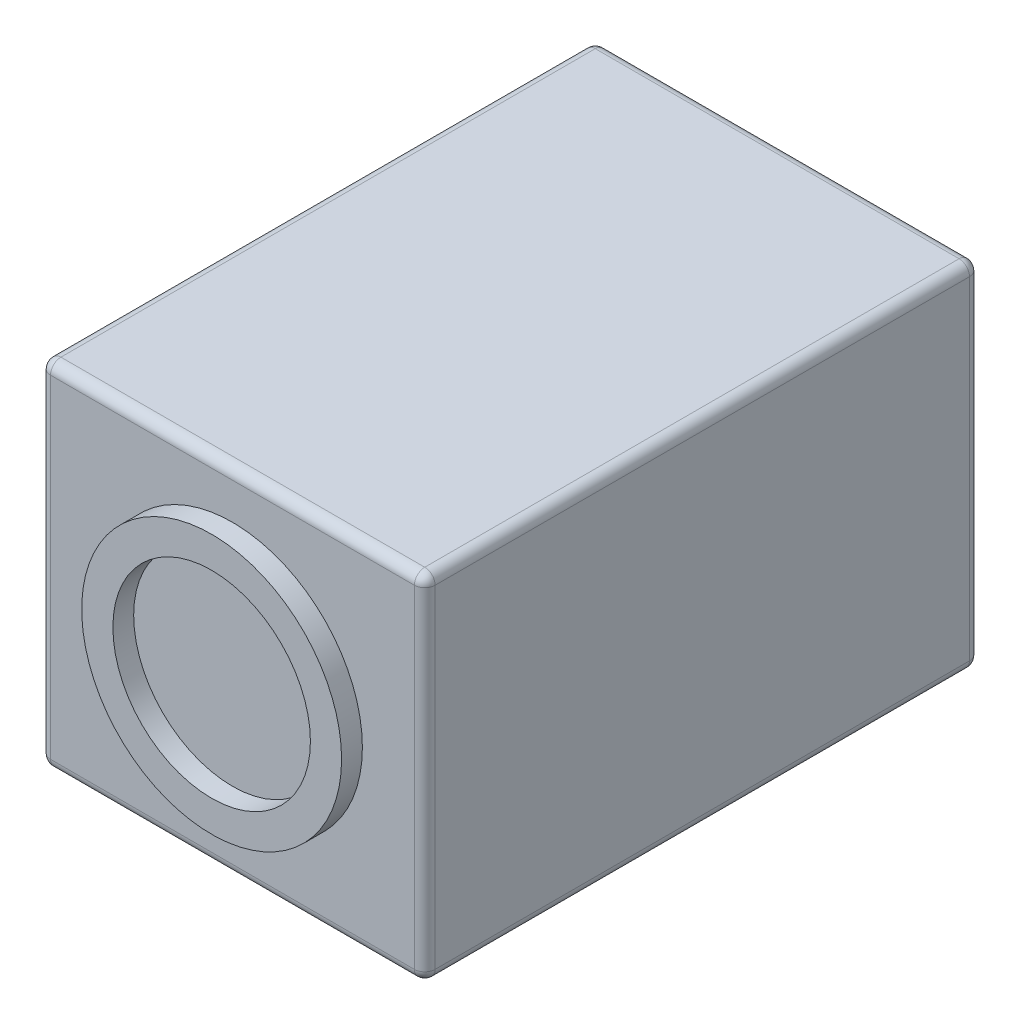
ISO-10303-21;
HEADER;
FILE_DESCRIPTION(('STEP AP214'),'2;1');
FILE_NAME('part.step','',(''),(''),'','','');
FILE_SCHEMA(('AUTOMOTIVE_DESIGN { 1 0 10303 214 1 1 1 1 }'));
ENDSEC;
DATA;
#1=APPLICATION_CONTEXT('core data for automotive mechanical design processes');
#2=APPLICATION_PROTOCOL_DEFINITION('international standard','automotive_design',2000,#1);
#3=PRODUCT_CONTEXT('',#1,'mechanical');
#4=PRODUCT('Part','Part','',(#3));
#5=PRODUCT_RELATED_PRODUCT_CATEGORY('part','',(#4));
#6=PRODUCT_DEFINITION_FORMATION('','',#4);
#7=PRODUCT_DEFINITION_CONTEXT('part definition',#1,'design');
#8=PRODUCT_DEFINITION('design','',#6,#7);
#9=PRODUCT_DEFINITION_SHAPE('','',#8);
#10=(LENGTH_UNIT() NAMED_UNIT(*) SI_UNIT(.MILLI.,.METRE.));
#11=(NAMED_UNIT(*) PLANE_ANGLE_UNIT() SI_UNIT($,.RADIAN.));
#12=(NAMED_UNIT(*) SI_UNIT($,.STERADIAN.) SOLID_ANGLE_UNIT());
#13=UNCERTAINTY_MEASURE_WITH_UNIT(LENGTH_MEASURE(1.E-05),#10,'distance_accuracy_value','');
#14=(GEOMETRIC_REPRESENTATION_CONTEXT(3) GLOBAL_UNCERTAINTY_ASSIGNED_CONTEXT((#13)) GLOBAL_UNIT_ASSIGNED_CONTEXT((#10,
#11,#12)) REPRESENTATION_CONTEXT('',''));
#15=CARTESIAN_POINT('',(0.,0.,0.));
#16=DIRECTION('',(0.,0.,1.));
#17=DIRECTION('',(1.,0.,0.));
#18=AXIS2_PLACEMENT_3D('',#15,#16,#17);
#19=CARTESIAN_POINT('',(-23.495,-21.59,67.818));
#20=DIRECTION('',(0.,0.,1.));
#21=DIRECTION('',(1.,0.,0.));
#22=AXIS2_PLACEMENT_3D('',#19,#20,#21);
#23=PLANE('',#22);
#24=DIRECTION('',(0.,-1.,0.));
#25=VECTOR('',#24,1.);
#26=CARTESIAN_POINT('',(-22.225,-21.59,67.818));
#27=LINE('',#26,#25);
#28=CARTESIAN_POINT('',(-22.225,20.32,67.818));
#29=VERTEX_POINT('',#28);
#30=CARTESIAN_POINT('',(-22.225,-20.32,67.818));
#31=VERTEX_POINT('',#30);
#32=EDGE_CURVE('E132',#29,#31,#27,.T.);
#33=ORIENTED_EDGE('',*,*,#32,.T.);
#34=DIRECTION('',(1.,0.,0.));
#35=VECTOR('',#34,1.);
#36=CARTESIAN_POINT('',(23.495,-20.32,67.818));
#37=LINE('',#36,#35);
#38=CARTESIAN_POINT('',(22.225,-20.32,67.818));
#39=VERTEX_POINT('',#38);
#40=EDGE_CURVE('E128',#31,#39,#37,.T.);
#41=ORIENTED_EDGE('',*,*,#40,.T.);
#42=DIRECTION('',(0.,1.,0.));
#43=VECTOR('',#42,1.);
#44=CARTESIAN_POINT('',(22.225,21.59,67.818));
#45=LINE('',#44,#43);
#46=CARTESIAN_POINT('',(22.225,20.32,67.818));
#47=VERTEX_POINT('',#46);
#48=EDGE_CURVE('E122',#39,#47,#45,.T.);
#49=ORIENTED_EDGE('',*,*,#48,.T.);
#50=DIRECTION('',(-1.,0.,0.));
#51=VECTOR('',#50,1.);
#52=CARTESIAN_POINT('',(-23.495,20.32,67.818));
#53=LINE('',#52,#51);
#54=EDGE_CURVE('E125',#47,#29,#53,.T.);
#55=ORIENTED_EDGE('',*,*,#54,.T.);
#56=EDGE_LOOP('',(#33,#41,#49,#55));
#57=FACE_BOUND('',#56,.T.);
#58=CARTESIAN_POINT('',(0.,0.,67.818));
#59=DIRECTION('',(0.,0.,1.));
#60=DIRECTION('',(1.,0.,0.));
#61=AXIS2_PLACEMENT_3D('',#58,#59,#60);
#62=CIRCLE('',#61,15.875);
#63=CARTESIAN_POINT('',(15.875,0.,67.818));
#64=VERTEX_POINT('',#63);
#65=EDGE_CURVE('E299',#64,#64,#62,.T.);
#66=ORIENTED_EDGE('',*,*,#65,.F.);
#67=EDGE_LOOP('',(#66));
#68=FACE_BOUND('',#67,.T.);
#69=ADVANCED_FACE('F34',(#57,#68),#23,.T.);
#70=CARTESIAN_POINT('',(-23.495,21.59,67.818));
#71=DIRECTION('',(1.,0.,0.));
#72=DIRECTION('',(0.,1.,0.));
#73=AXIS2_PLACEMENT_3D('',#70,#71,#72);
#74=PLANE('',#73);
#75=DIRECTION('',(0.,0.,-1.));
#76=VECTOR('',#75,1.);
#77=CARTESIAN_POINT('',(-23.495,-20.32,67.818));
#78=LINE('',#77,#76);
#79=CARTESIAN_POINT('',(-23.495,-20.32,1.26999999999999));
#80=VERTEX_POINT('',#79);
#81=CARTESIAN_POINT('',(-23.495,-20.32,66.548));
#82=VERTEX_POINT('',#81);
#83=EDGE_CURVE('E230',#80,#82,#78,.F.);
#84=ORIENTED_EDGE('',*,*,#83,.T.);
#85=DIRECTION('',(0.,-1.,0.));
#86=VECTOR('',#85,1.);
#87=CARTESIAN_POINT('',(-23.495,21.59,66.548));
#88=LINE('',#87,#86);
#89=CARTESIAN_POINT('',(-23.495,20.32,66.548));
#90=VERTEX_POINT('',#89);
#91=EDGE_CURVE('E232',#82,#90,#88,.F.);
#92=ORIENTED_EDGE('',*,*,#91,.T.);
#93=DIRECTION('',(0.,0.,-1.));
#94=VECTOR('',#93,1.);
#95=CARTESIAN_POINT('',(-23.495,20.32,67.818));
#96=LINE('',#95,#94);
#97=CARTESIAN_POINT('',(-23.495,20.32,1.26999999999999));
#98=VERTEX_POINT('',#97);
#99=EDGE_CURVE('E226',#90,#98,#96,.T.);
#100=ORIENTED_EDGE('',*,*,#99,.T.);
#101=DIRECTION('',(0.,-1.,0.));
#102=VECTOR('',#101,1.);
#103=CARTESIAN_POINT('',(-23.495,21.59,1.26999999999999));
#104=LINE('',#103,#102);
#105=EDGE_CURVE('E228',#98,#80,#104,.T.);
#106=ORIENTED_EDGE('',*,*,#105,.T.);
#107=EDGE_LOOP('',(#84,#92,#100,#106));
#108=FACE_BOUND('',#107,.T.);
#109=ADVANCED_FACE('F36',(#108),#74,.F.);
#110=CARTESIAN_POINT('',(-23.495,-21.59,67.818));
#111=DIRECTION('',(0.,1.,0.));
#112=DIRECTION('',(-1.,0.,0.));
#113=AXIS2_PLACEMENT_3D('',#110,#111,#112);
#114=PLANE('',#113);
#115=CARTESIAN_POINT('',(10.795,-21.59,39.1795));
#116=DIRECTION('',(0.,-1.,0.));
#117=DIRECTION('',(1.,0.,0.));
#118=AXIS2_PLACEMENT_3D('',#115,#116,#117);
#119=CIRCLE('',#118,1.0795);
#120=CARTESIAN_POINT('',(11.8745,-21.59,39.1795));
#121=VERTEX_POINT('',#120);
#122=EDGE_CURVE('E314',#121,#121,#119,.T.);
#123=ORIENTED_EDGE('',*,*,#122,.F.);
#124=EDGE_LOOP('',(#123));
#125=FACE_BOUND('',#124,.T.);
#126=CARTESIAN_POINT('',(-10.922,-21.59,39.1795));
#127=DIRECTION('',(0.,-1.,0.));
#128=DIRECTION('',(1.,0.,0.));
#129=AXIS2_PLACEMENT_3D('',#126,#127,#128);
#130=CIRCLE('',#129,1.0795);
#131=CARTESIAN_POINT('',(-9.8425,-21.59,39.1795));
#132=VERTEX_POINT('',#131);
#133=EDGE_CURVE('E308',#132,#132,#130,.T.);
#134=ORIENTED_EDGE('',*,*,#133,.F.);
#135=EDGE_LOOP('',(#134));
#136=FACE_BOUND('',#135,.T.);
#137=DIRECTION('',(1.,0.,0.));
#138=VECTOR('',#137,1.);
#139=CARTESIAN_POINT('',(-23.495,-21.59,1.26999999999999));
#140=LINE('',#139,#138);
#141=CARTESIAN_POINT('',(-22.225,-21.59,1.26999999999999));
#142=VERTEX_POINT('',#141);
#143=CARTESIAN_POINT('',(22.225,-21.59,1.26999999999999));
#144=VERTEX_POINT('',#143);
#145=EDGE_CURVE('E202',#142,#144,#140,.T.);
#146=ORIENTED_EDGE('',*,*,#145,.T.);
#147=DIRECTION('',(0.,0.,-1.));
#148=VECTOR('',#147,1.);
#149=CARTESIAN_POINT('',(22.225,-21.59,67.818));
#150=LINE('',#149,#148);
#151=CARTESIAN_POINT('',(22.225,-21.59,66.548));
#152=VERTEX_POINT('',#151);
#153=EDGE_CURVE('E207',#144,#152,#150,.F.);
#154=ORIENTED_EDGE('',*,*,#153,.T.);
#155=DIRECTION('',(1.,0.,0.));
#156=VECTOR('',#155,1.);
#157=CARTESIAN_POINT('',(-23.495,-21.59,66.548));
#158=LINE('',#157,#156);
#159=CARTESIAN_POINT('',(-22.225,-21.59,66.548));
#160=VERTEX_POINT('',#159);
#161=EDGE_CURVE('E204',#152,#160,#158,.F.);
#162=ORIENTED_EDGE('',*,*,#161,.T.);
#163=DIRECTION('',(0.,0.,-1.));
#164=VECTOR('',#163,1.);
#165=CARTESIAN_POINT('',(-22.225,-21.59,67.818));
#166=LINE('',#165,#164);
#167=EDGE_CURVE('E200',#160,#142,#166,.T.);
#168=ORIENTED_EDGE('',*,*,#167,.T.);
#169=EDGE_LOOP('',(#146,#154,#162,#168));
#170=FACE_BOUND('',#169,.T.);
#171=ADVANCED_FACE('F320',(#125,#136,#170),#114,.F.);
#172=CARTESIAN_POINT('',(23.495,21.59,67.818));
#173=DIRECTION('',(-1.,0.,0.));
#174=DIRECTION('',(0.,-1.,0.));
#175=AXIS2_PLACEMENT_3D('',#172,#173,#174);
#176=PLANE('',#175);
#177=DIRECTION('',(0.,1.,0.));
#178=VECTOR('',#177,1.);
#179=CARTESIAN_POINT('',(23.495,-21.59,66.548));
#180=LINE('',#179,#178);
#181=CARTESIAN_POINT('',(23.495,20.32,66.548));
#182=VERTEX_POINT('',#181);
#183=CARTESIAN_POINT('',(23.495,-20.32,66.548));
#184=VERTEX_POINT('',#183);
#185=EDGE_CURVE('E154',#182,#184,#180,.F.);
#186=ORIENTED_EDGE('',*,*,#185,.T.);
#187=DIRECTION('',(0.,0.,-1.));
#188=VECTOR('',#187,1.);
#189=CARTESIAN_POINT('',(23.495,-20.32,67.818));
#190=LINE('',#189,#188);
#191=CARTESIAN_POINT('',(23.495,-20.32,1.26999999999999));
#192=VERTEX_POINT('',#191);
#193=EDGE_CURVE('E223',#184,#192,#190,.T.);
#194=ORIENTED_EDGE('',*,*,#193,.T.);
#195=DIRECTION('',(0.,1.,0.));
#196=VECTOR('',#195,1.);
#197=CARTESIAN_POINT('',(23.495,21.59,1.26999999999999));
#198=LINE('',#197,#196);
#199=CARTESIAN_POINT('',(23.495,20.32,1.26999999999999));
#200=VERTEX_POINT('',#199);
#201=EDGE_CURVE('E220',#192,#200,#198,.T.);
#202=ORIENTED_EDGE('',*,*,#201,.T.);
#203=DIRECTION('',(0.,0.,-1.));
#204=VECTOR('',#203,1.);
#205=CARTESIAN_POINT('',(23.495,20.32,67.818));
#206=LINE('',#205,#204);
#207=EDGE_CURVE('E218',#200,#182,#206,.F.);
#208=ORIENTED_EDGE('',*,*,#207,.T.);
#209=EDGE_LOOP('',(#186,#194,#202,#208));
#210=FACE_BOUND('',#209,.T.);
#211=ADVANCED_FACE('F323',(#210),#176,.F.);
#212=CARTESIAN_POINT('',(-23.495,21.59,67.818));
#213=DIRECTION('',(0.,-1.,0.));
#214=DIRECTION('',(1.,0.,0.));
#215=AXIS2_PLACEMENT_3D('',#212,#213,#214);
#216=PLANE('',#215);
#217=DIRECTION('',(-1.,0.,0.));
#218=VECTOR('',#217,1.);
#219=CARTESIAN_POINT('',(23.495,21.59,66.548));
#220=LINE('',#219,#218);
#221=CARTESIAN_POINT('',(-22.225,21.59,66.548));
#222=VERTEX_POINT('',#221);
#223=CARTESIAN_POINT('',(22.225,21.59,66.548));
#224=VERTEX_POINT('',#223);
#225=EDGE_CURVE('E49',#222,#224,#220,.F.);
#226=ORIENTED_EDGE('',*,*,#225,.T.);
#227=DIRECTION('',(0.,0.,-1.));
#228=VECTOR('',#227,1.);
#229=CARTESIAN_POINT('',(22.225,21.59,67.818));
#230=LINE('',#229,#228);
#231=CARTESIAN_POINT('',(22.225,21.59,1.26999999999999));
#232=VERTEX_POINT('',#231);
#233=EDGE_CURVE('E42',#224,#232,#230,.T.);
#234=ORIENTED_EDGE('',*,*,#233,.T.);
#235=DIRECTION('',(-1.,0.,0.));
#236=VECTOR('',#235,1.);
#237=CARTESIAN_POINT('',(-23.495,21.59,1.26999999999999));
#238=LINE('',#237,#236);
#239=CARTESIAN_POINT('',(-22.225,21.59,1.26999999999999));
#240=VERTEX_POINT('',#239);
#241=EDGE_CURVE('E235',#232,#240,#238,.T.);
#242=ORIENTED_EDGE('',*,*,#241,.T.);
#243=DIRECTION('',(0.,0.,-1.));
#244=VECTOR('',#243,1.);
#245=CARTESIAN_POINT('',(-22.225,21.59,67.818));
#246=LINE('',#245,#244);
#247=EDGE_CURVE('E54',#240,#222,#246,.F.);
#248=ORIENTED_EDGE('',*,*,#247,.T.);
#249=EDGE_LOOP('',(#226,#234,#242,#248));
#250=FACE_BOUND('',#249,.T.);
#251=ADVANCED_FACE('F238',(#250),#216,.F.);
#252=CARTESIAN_POINT('',(-23.495,-21.59,0.));
#253=DIRECTION('',(0.,0.,1.));
#254=DIRECTION('',(1.,0.,0.));
#255=AXIS2_PLACEMENT_3D('',#252,#253,#254);
#256=PLANE('',#255);
#257=DIRECTION('',(0.,1.,0.));
#258=VECTOR('',#257,1.);
#259=CARTESIAN_POINT('',(22.225,-21.59,0.));
#260=LINE('',#259,#258);
#261=CARTESIAN_POINT('',(22.225,20.32,0.));
#262=VERTEX_POINT('',#261);
#263=CARTESIAN_POINT('',(22.225,-20.32,0.));
#264=VERTEX_POINT('',#263);
#265=EDGE_CURVE('E213',#262,#264,#260,.F.);
#266=ORIENTED_EDGE('',*,*,#265,.T.);
#267=DIRECTION('',(1.,0.,0.));
#268=VECTOR('',#267,1.);
#269=CARTESIAN_POINT('',(-23.495,-20.32,0.));
#270=LINE('',#269,#268);
#271=CARTESIAN_POINT('',(-22.225,-20.32,0.));
#272=VERTEX_POINT('',#271);
#273=EDGE_CURVE('E215',#264,#272,#270,.F.);
#274=ORIENTED_EDGE('',*,*,#273,.T.);
#275=DIRECTION('',(0.,-1.,0.));
#276=VECTOR('',#275,1.);
#277=CARTESIAN_POINT('',(-22.225,-21.59,0.));
#278=LINE('',#277,#276);
#279=CARTESIAN_POINT('',(-22.225,20.32,0.));
#280=VERTEX_POINT('',#279);
#281=EDGE_CURVE('E211',#272,#280,#278,.F.);
#282=ORIENTED_EDGE('',*,*,#281,.T.);
#283=DIRECTION('',(-1.,0.,0.));
#284=VECTOR('',#283,1.);
#285=CARTESIAN_POINT('',(-23.495,20.32,0.));
#286=LINE('',#285,#284);
#287=EDGE_CURVE('E209',#280,#262,#286,.F.);
#288=ORIENTED_EDGE('',*,*,#287,.T.);
#289=EDGE_LOOP('',(#266,#274,#282,#288));
#290=FACE_BOUND('',#289,.T.);
#291=ADVANCED_FACE('F345',(#290),#256,.F.);
#292=CARTESIAN_POINT('',(-23.495,20.32,1.26999999999999));
#293=DIRECTION('',(-1.,0.,0.));
#294=DIRECTION('',(0.,-1.,0.));
#295=AXIS2_PLACEMENT_3D('',#292,#293,#294);
#296=CYLINDRICAL_SURFACE('',#295,1.27);
#297=CARTESIAN_POINT('',(-22.225,20.32,1.26999999999999));
#298=DIRECTION('',(-1.,0.,0.));
#299=DIRECTION('',(0.,0.,1.));
#300=AXIS2_PLACEMENT_3D('',#297,#298,#299);
#301=CIRCLE('',#300,1.27);
#302=EDGE_CURVE('E143',#240,#280,#301,.T.);
#303=ORIENTED_EDGE('',*,*,#302,.F.);
#304=ORIENTED_EDGE('',*,*,#241,.F.);
#305=CARTESIAN_POINT('',(22.225,20.32,1.27));
#306=DIRECTION('',(1.,0.,0.));
#307=DIRECTION('',(0.,0.,-1.));
#308=AXIS2_PLACEMENT_3D('',#305,#306,#307);
#309=CIRCLE('',#308,1.27);
#310=EDGE_CURVE('E193',#262,#232,#309,.T.);
#311=ORIENTED_EDGE('',*,*,#310,.F.);
#312=ORIENTED_EDGE('',*,*,#287,.F.);
#313=EDGE_LOOP('',(#303,#304,#311,#312));
#314=FACE_BOUND('',#313,.T.);
#315=ADVANCED_FACE('F252',(#314),#296,.T.);
#316=CARTESIAN_POINT('',(-22.225,20.32,1.27));
#317=DIRECTION('',(0.,0.,1.));
#318=DIRECTION('',(1.,0.,0.));
#319=AXIS2_PLACEMENT_3D('',#316,#317,#318);
#320=SPHERICAL_SURFACE('',#319,1.27);
#321=CARTESIAN_POINT('',(-22.225,20.32,1.26999999999999));
#322=DIRECTION('',(0.,0.,-1.));
#323=DIRECTION('',(-1.,0.,0.));
#324=AXIS2_PLACEMENT_3D('',#321,#322,#323);
#325=CIRCLE('',#324,1.27);
#326=EDGE_CURVE('E187',#240,#98,#325,.F.);
#327=ORIENTED_EDGE('',*,*,#326,.F.);
#328=ORIENTED_EDGE('',*,*,#302,.T.);
#329=CARTESIAN_POINT('',(-22.225,20.32,1.27));
#330=DIRECTION('',(0.,1.,0.));
#331=DIRECTION('',(0.,0.,1.));
#332=AXIS2_PLACEMENT_3D('',#329,#330,#331);
#333=CIRCLE('',#332,1.27);
#334=EDGE_CURVE('E190',#98,#280,#333,.F.);
#335=ORIENTED_EDGE('',*,*,#334,.F.);
#336=EDGE_LOOP('',(#327,#328,#335));
#337=FACE_BOUND('',#336,.T.);
#338=ADVANCED_FACE('F256',(#337),#320,.T.);
#339=CARTESIAN_POINT('',(22.225,20.32,1.27));
#340=DIRECTION('',(0.,0.,1.));
#341=DIRECTION('',(1.,0.,0.));
#342=AXIS2_PLACEMENT_3D('',#339,#340,#341);
#343=SPHERICAL_SURFACE('',#342,1.27);
#344=CARTESIAN_POINT('',(22.225,20.32,1.26999999999999));
#345=DIRECTION('',(0.,1.,0.));
#346=DIRECTION('',(0.,0.,1.));
#347=AXIS2_PLACEMENT_3D('',#344,#345,#346);
#348=CIRCLE('',#347,1.27);
#349=EDGE_CURVE('E182',#262,#200,#348,.F.);
#350=ORIENTED_EDGE('',*,*,#349,.F.);
#351=ORIENTED_EDGE('',*,*,#310,.T.);
#352=CARTESIAN_POINT('',(22.225,20.32,1.26999999999999));
#353=DIRECTION('',(0.,0.,-1.));
#354=DIRECTION('',(-1.,0.,0.));
#355=AXIS2_PLACEMENT_3D('',#352,#353,#354);
#356=CIRCLE('',#355,1.27);
#357=EDGE_CURVE('E185',#200,#232,#356,.F.);
#358=ORIENTED_EDGE('',*,*,#357,.F.);
#359=EDGE_LOOP('',(#350,#351,#358));
#360=FACE_BOUND('',#359,.T.);
#361=ADVANCED_FACE('F248',(#360),#343,.T.);
#362=CARTESIAN_POINT('',(-22.225,21.59,1.26999999999999));
#363=DIRECTION('',(0.,-1.,0.));
#364=DIRECTION('',(1.,0.,0.));
#365=AXIS2_PLACEMENT_3D('',#362,#363,#364);
#366=CYLINDRICAL_SURFACE('',#365,1.27);
#367=ORIENTED_EDGE('',*,*,#334,.T.);
#368=ORIENTED_EDGE('',*,*,#281,.F.);
#369=CARTESIAN_POINT('',(-22.225,-20.32,1.26999999999999));
#370=DIRECTION('',(0.,-1.,0.));
#371=DIRECTION('',(0.,0.,-1.));
#372=AXIS2_PLACEMENT_3D('',#369,#370,#371);
#373=CIRCLE('',#372,1.27);
#374=EDGE_CURVE('E177',#80,#272,#373,.T.);
#375=ORIENTED_EDGE('',*,*,#374,.F.);
#376=ORIENTED_EDGE('',*,*,#105,.F.);
#377=EDGE_LOOP('',(#367,#368,#375,#376));
#378=FACE_BOUND('',#377,.T.);
#379=ADVANCED_FACE('F349',(#378),#366,.T.);
#380=CARTESIAN_POINT('',(-22.225,20.32,67.818));
#381=DIRECTION('',(0.,0.,-1.));
#382=DIRECTION('',(-1.,0.,0.));
#383=AXIS2_PLACEMENT_3D('',#380,#381,#382);
#384=CYLINDRICAL_SURFACE('',#383,1.27);
#385=ORIENTED_EDGE('',*,*,#326,.T.);
#386=ORIENTED_EDGE('',*,*,#99,.F.);
#387=CARTESIAN_POINT('',(-22.225,20.32,66.548));
#388=DIRECTION('',(0.,0.,1.));
#389=DIRECTION('',(1.,0.,0.));
#390=AXIS2_PLACEMENT_3D('',#387,#388,#389);
#391=CIRCLE('',#390,1.27);
#392=EDGE_CURVE('E174',#222,#90,#391,.T.);
#393=ORIENTED_EDGE('',*,*,#392,.F.);
#394=ORIENTED_EDGE('',*,*,#247,.F.);
#395=EDGE_LOOP('',(#385,#386,#393,#394));
#396=FACE_BOUND('',#395,.T.);
#397=ADVANCED_FACE('F261',(#396),#384,.T.);
#398=CARTESIAN_POINT('',(-23.495,20.32,66.548));
#399=DIRECTION('',(1.,0.,0.));
#400=DIRECTION('',(0.,1.,0.));
#401=AXIS2_PLACEMENT_3D('',#398,#399,#400);
#402=CYLINDRICAL_SURFACE('',#401,1.27);
#403=CARTESIAN_POINT('',(22.225,20.32,66.548));
#404=DIRECTION('',(1.,0.,0.));
#405=DIRECTION('',(0.,0.,-1.));
#406=AXIS2_PLACEMENT_3D('',#403,#404,#405);
#407=CIRCLE('',#406,1.27);
#408=EDGE_CURVE('E138',#224,#47,#407,.T.);
#409=ORIENTED_EDGE('',*,*,#408,.F.);
#410=ORIENTED_EDGE('',*,*,#225,.F.);
#411=CARTESIAN_POINT('',(-22.225,20.32,66.548));
#412=DIRECTION('',(-1.,0.,0.));
#413=DIRECTION('',(0.,0.,1.));
#414=AXIS2_PLACEMENT_3D('',#411,#412,#413);
#415=CIRCLE('',#414,1.27);
#416=EDGE_CURVE('E141',#29,#222,#415,.T.);
#417=ORIENTED_EDGE('',*,*,#416,.F.);
#418=ORIENTED_EDGE('',*,*,#54,.F.);
#419=EDGE_LOOP('',(#409,#410,#417,#418));
#420=FACE_BOUND('',#419,.T.);
#421=ADVANCED_FACE('F137',(#420),#402,.T.);
#422=CARTESIAN_POINT('',(22.225,20.32,67.818));
#423=DIRECTION('',(0.,0.,-1.));
#424=DIRECTION('',(-1.,0.,0.));
#425=AXIS2_PLACEMENT_3D('',#422,#423,#424);
#426=CYLINDRICAL_SURFACE('',#425,1.27);
#427=ORIENTED_EDGE('',*,*,#357,.T.);
#428=ORIENTED_EDGE('',*,*,#233,.F.);
#429=CARTESIAN_POINT('',(22.225,20.32,66.548));
#430=DIRECTION('',(0.,0.,1.));
#431=DIRECTION('',(1.,0.,0.));
#432=AXIS2_PLACEMENT_3D('',#429,#430,#431);
#433=CIRCLE('',#432,1.27);
#434=EDGE_CURVE('E151',#182,#224,#433,.T.);
#435=ORIENTED_EDGE('',*,*,#434,.F.);
#436=ORIENTED_EDGE('',*,*,#207,.F.);
#437=EDGE_LOOP('',(#427,#428,#435,#436));
#438=FACE_BOUND('',#437,.T.);
#439=ADVANCED_FACE('F242',(#438),#426,.T.);
#440=CARTESIAN_POINT('',(22.225,21.59,1.26999999999999));
#441=DIRECTION('',(0.,1.,0.));
#442=DIRECTION('',(-1.,0.,0.));
#443=AXIS2_PLACEMENT_3D('',#440,#441,#442);
#444=CYLINDRICAL_SURFACE('',#443,1.27);
#445=ORIENTED_EDGE('',*,*,#349,.T.);
#446=ORIENTED_EDGE('',*,*,#201,.F.);
#447=CARTESIAN_POINT('',(22.225,-20.32,1.27));
#448=DIRECTION('',(0.,-1.,0.));
#449=DIRECTION('',(0.,0.,-1.));
#450=AXIS2_PLACEMENT_3D('',#447,#448,#449);
#451=CIRCLE('',#450,1.27);
#452=EDGE_CURVE('E169',#264,#192,#451,.T.);
#453=ORIENTED_EDGE('',*,*,#452,.F.);
#454=ORIENTED_EDGE('',*,*,#265,.F.);
#455=EDGE_LOOP('',(#445,#446,#453,#454));
#456=FACE_BOUND('',#455,.T.);
#457=ADVANCED_FACE('F343',(#456),#444,.T.);
#458=CARTESIAN_POINT('',(-23.495,-20.32,1.26999999999999));
#459=DIRECTION('',(1.,0.,0.));
#460=DIRECTION('',(0.,1.,0.));
#461=AXIS2_PLACEMENT_3D('',#458,#459,#460);
#462=CYLINDRICAL_SURFACE('',#461,1.27);
#463=CARTESIAN_POINT('',(-22.225,-20.32,1.27));
#464=DIRECTION('',(-1.,0.,0.));
#465=DIRECTION('',(0.,0.,1.));
#466=AXIS2_PLACEMENT_3D('',#463,#464,#465);
#467=CIRCLE('',#466,1.27);
#468=EDGE_CURVE('E179',#272,#142,#467,.T.);
#469=ORIENTED_EDGE('',*,*,#468,.F.);
#470=ORIENTED_EDGE('',*,*,#273,.F.);
#471=CARTESIAN_POINT('',(22.225,-20.32,1.26999999999999));
#472=DIRECTION('',(1.,0.,0.));
#473=DIRECTION('',(0.,0.,-1.));
#474=AXIS2_PLACEMENT_3D('',#471,#472,#473);
#475=CIRCLE('',#474,1.27);
#476=EDGE_CURVE('E166',#144,#264,#475,.T.);
#477=ORIENTED_EDGE('',*,*,#476,.F.);
#478=ORIENTED_EDGE('',*,*,#145,.F.);
#479=EDGE_LOOP('',(#469,#470,#477,#478));
#480=FACE_BOUND('',#479,.T.);
#481=ADVANCED_FACE('F333',(#480),#462,.T.);
#482=CARTESIAN_POINT('',(-22.225,-20.32,1.27));
#483=DIRECTION('',(0.,0.,1.));
#484=DIRECTION('',(1.,0.,0.));
#485=AXIS2_PLACEMENT_3D('',#482,#483,#484);
#486=SPHERICAL_SURFACE('',#485,1.27);
#487=ORIENTED_EDGE('',*,*,#374,.T.);
#488=ORIENTED_EDGE('',*,*,#468,.T.);
#489=CARTESIAN_POINT('',(-22.225,-20.32,1.26999999999999));
#490=DIRECTION('',(0.,0.,-1.));
#491=DIRECTION('',(-1.,0.,0.));
#492=AXIS2_PLACEMENT_3D('',#489,#490,#491);
#493=CIRCLE('',#492,1.27);
#494=EDGE_CURVE('E158',#80,#142,#493,.F.);
#495=ORIENTED_EDGE('',*,*,#494,.F.);
#496=EDGE_LOOP('',(#487,#488,#495));
#497=FACE_BOUND('',#496,.T.);
#498=ADVANCED_FACE('F356',(#497),#486,.T.);
#499=CARTESIAN_POINT('',(-22.225,20.32,66.548));
#500=DIRECTION('',(0.,0.,1.));
#501=DIRECTION('',(1.,0.,0.));
#502=AXIS2_PLACEMENT_3D('',#499,#500,#501);
#503=SPHERICAL_SURFACE('',#502,1.27);
#504=ORIENTED_EDGE('',*,*,#416,.T.);
#505=ORIENTED_EDGE('',*,*,#392,.T.);
#506=CARTESIAN_POINT('',(-22.225,20.32,66.548));
#507=DIRECTION('',(0.,1.,0.));
#508=DIRECTION('',(0.,0.,1.));
#509=AXIS2_PLACEMENT_3D('',#506,#507,#508);
#510=CIRCLE('',#509,1.27);
#511=EDGE_CURVE('E155',#29,#90,#510,.F.);
#512=ORIENTED_EDGE('',*,*,#511,.F.);
#513=EDGE_LOOP('',(#504,#505,#512));
#514=FACE_BOUND('',#513,.T.);
#515=ADVANCED_FACE('F263',(#514),#503,.T.);
#516=CARTESIAN_POINT('',(22.225,20.32,66.548));
#517=DIRECTION('',(0.,0.,1.));
#518=DIRECTION('',(1.,0.,0.));
#519=AXIS2_PLACEMENT_3D('',#516,#517,#518);
#520=SPHERICAL_SURFACE('',#519,1.27);
#521=ORIENTED_EDGE('',*,*,#434,.T.);
#522=ORIENTED_EDGE('',*,*,#408,.T.);
#523=CARTESIAN_POINT('',(22.225,20.32,66.548));
#524=DIRECTION('',(0.,1.,0.));
#525=DIRECTION('',(-1.,0.,0.));
#526=AXIS2_PLACEMENT_3D('',#523,#524,#525);
#527=CIRCLE('',#526,1.27);
#528=EDGE_CURVE('E148',#182,#47,#527,.F.);
#529=ORIENTED_EDGE('',*,*,#528,.F.);
#530=EDGE_LOOP('',(#521,#522,#529));
#531=FACE_BOUND('',#530,.T.);
#532=ADVANCED_FACE('F147',(#531),#520,.T.);
#533=CARTESIAN_POINT('',(22.225,-20.32,1.27));
#534=DIRECTION('',(0.,0.,1.));
#535=DIRECTION('',(1.,0.,0.));
#536=AXIS2_PLACEMENT_3D('',#533,#534,#535);
#537=SPHERICAL_SURFACE('',#536,1.27);
#538=ORIENTED_EDGE('',*,*,#476,.T.);
#539=ORIENTED_EDGE('',*,*,#452,.T.);
#540=CARTESIAN_POINT('',(22.225,-20.32,1.26999999999999));
#541=DIRECTION('',(0.,0.,-1.));
#542=DIRECTION('',(-1.,0.,0.));
#543=AXIS2_PLACEMENT_3D('',#540,#541,#542);
#544=CIRCLE('',#543,1.27);
#545=EDGE_CURVE('E156',#144,#192,#544,.F.);
#546=ORIENTED_EDGE('',*,*,#545,.F.);
#547=EDGE_LOOP('',(#538,#539,#546));
#548=FACE_BOUND('',#547,.T.);
#549=ADVANCED_FACE('F336',(#548),#537,.T.);
#550=CARTESIAN_POINT('',(-22.225,-20.32,67.818));
#551=DIRECTION('',(0.,0.,-1.));
#552=DIRECTION('',(-1.,0.,0.));
#553=AXIS2_PLACEMENT_3D('',#550,#551,#552);
#554=CYLINDRICAL_SURFACE('',#553,1.27);
#555=ORIENTED_EDGE('',*,*,#494,.T.);
#556=ORIENTED_EDGE('',*,*,#167,.F.);
#557=CARTESIAN_POINT('',(-22.225,-20.32,66.548));
#558=DIRECTION('',(0.,0.,1.));
#559=DIRECTION('',(1.,0.,0.));
#560=AXIS2_PLACEMENT_3D('',#557,#558,#559);
#561=CIRCLE('',#560,1.27);
#562=EDGE_CURVE('E160',#82,#160,#561,.T.);
#563=ORIENTED_EDGE('',*,*,#562,.F.);
#564=ORIENTED_EDGE('',*,*,#83,.F.);
#565=EDGE_LOOP('',(#555,#556,#563,#564));
#566=FACE_BOUND('',#565,.T.);
#567=ADVANCED_FACE('F354',(#566),#554,.T.);
#568=CARTESIAN_POINT('',(-22.225,-21.59,66.548));
#569=DIRECTION('',(0.,1.,0.));
#570=DIRECTION('',(-1.,0.,0.));
#571=AXIS2_PLACEMENT_3D('',#568,#569,#570);
#572=CYLINDRICAL_SURFACE('',#571,1.27);
#573=ORIENTED_EDGE('',*,*,#511,.T.);
#574=ORIENTED_EDGE('',*,*,#91,.F.);
#575=CARTESIAN_POINT('',(-22.225,-20.32,66.548));
#576=DIRECTION('',(0.,-1.,0.));
#577=DIRECTION('',(0.,0.,-1.));
#578=AXIS2_PLACEMENT_3D('',#575,#576,#577);
#579=CIRCLE('',#578,1.27);
#580=EDGE_CURVE('E270',#31,#82,#579,.T.);
#581=ORIENTED_EDGE('',*,*,#580,.F.);
#582=ORIENTED_EDGE('',*,*,#32,.F.);
#583=EDGE_LOOP('',(#573,#574,#581,#582));
#584=FACE_BOUND('',#583,.T.);
#585=ADVANCED_FACE('F268',(#584),#572,.T.);
#586=CARTESIAN_POINT('',(22.225,-21.59,66.548));
#587=DIRECTION('',(0.,-1.,0.));
#588=DIRECTION('',(1.,0.,0.));
#589=AXIS2_PLACEMENT_3D('',#586,#587,#588);
#590=CYLINDRICAL_SURFACE('',#589,1.27);
#591=ORIENTED_EDGE('',*,*,#528,.T.);
#592=ORIENTED_EDGE('',*,*,#48,.F.);
#593=CARTESIAN_POINT('',(22.225,-20.32,66.548));
#594=DIRECTION('',(0.,-1.,0.));
#595=DIRECTION('',(0.,0.,-1.));
#596=AXIS2_PLACEMENT_3D('',#593,#594,#595);
#597=CIRCLE('',#596,1.27);
#598=EDGE_CURVE('E275',#184,#39,#597,.T.);
#599=ORIENTED_EDGE('',*,*,#598,.F.);
#600=ORIENTED_EDGE('',*,*,#185,.F.);
#601=EDGE_LOOP('',(#591,#592,#599,#600));
#602=FACE_BOUND('',#601,.T.);
#603=ADVANCED_FACE('F153',(#602),#590,.T.);
#604=CARTESIAN_POINT('',(22.225,-20.32,67.818));
#605=DIRECTION('',(0.,0.,-1.));
#606=DIRECTION('',(-1.,0.,0.));
#607=AXIS2_PLACEMENT_3D('',#604,#605,#606);
#608=CYLINDRICAL_SURFACE('',#607,1.27);
#609=ORIENTED_EDGE('',*,*,#545,.T.);
#610=ORIENTED_EDGE('',*,*,#193,.F.);
#611=CARTESIAN_POINT('',(22.225,-20.32,66.548));
#612=DIRECTION('',(0.,0.,1.));
#613=DIRECTION('',(1.,0.,0.));
#614=AXIS2_PLACEMENT_3D('',#611,#612,#613);
#615=CIRCLE('',#614,1.27);
#616=EDGE_CURVE('E282',#152,#184,#615,.T.);
#617=ORIENTED_EDGE('',*,*,#616,.F.);
#618=ORIENTED_EDGE('',*,*,#153,.F.);
#619=EDGE_LOOP('',(#609,#610,#617,#618));
#620=FACE_BOUND('',#619,.T.);
#621=ADVANCED_FACE('F340',(#620),#608,.T.);
#622=CARTESIAN_POINT('',(-22.225,-20.32,66.548));
#623=DIRECTION('',(0.,0.,1.));
#624=DIRECTION('',(1.,0.,0.));
#625=AXIS2_PLACEMENT_3D('',#622,#623,#624);
#626=SPHERICAL_SURFACE('',#625,1.27);
#627=ORIENTED_EDGE('',*,*,#580,.T.);
#628=ORIENTED_EDGE('',*,*,#562,.T.);
#629=CARTESIAN_POINT('',(-22.225,-20.32,66.548));
#630=DIRECTION('',(-1.,0.,0.));
#631=DIRECTION('',(0.,0.,1.));
#632=AXIS2_PLACEMENT_3D('',#629,#630,#631);
#633=CIRCLE('',#632,1.27);
#634=EDGE_CURVE('E277',#31,#160,#633,.F.);
#635=ORIENTED_EDGE('',*,*,#634,.F.);
#636=EDGE_LOOP('',(#627,#628,#635));
#637=FACE_BOUND('',#636,.T.);
#638=ADVANCED_FACE('F278',(#637),#626,.T.);
#639=CARTESIAN_POINT('',(22.225,-20.32,66.548));
#640=DIRECTION('',(0.,0.,1.));
#641=DIRECTION('',(1.,0.,0.));
#642=AXIS2_PLACEMENT_3D('',#639,#640,#641);
#643=SPHERICAL_SURFACE('',#642,1.27);
#644=ORIENTED_EDGE('',*,*,#616,.T.);
#645=ORIENTED_EDGE('',*,*,#598,.T.);
#646=CARTESIAN_POINT('',(22.225,-20.32,66.548));
#647=DIRECTION('',(1.,0.,0.));
#648=DIRECTION('',(0.,1.,0.));
#649=AXIS2_PLACEMENT_3D('',#646,#647,#648);
#650=CIRCLE('',#649,1.27);
#651=EDGE_CURVE('E283',#152,#39,#650,.F.);
#652=ORIENTED_EDGE('',*,*,#651,.F.);
#653=EDGE_LOOP('',(#644,#645,#652));
#654=FACE_BOUND('',#653,.T.);
#655=ADVANCED_FACE('F292',(#654),#643,.T.);
#656=CARTESIAN_POINT('',(-23.495,-20.32,66.548));
#657=DIRECTION('',(-1.,0.,0.));
#658=DIRECTION('',(0.,-1.,0.));
#659=AXIS2_PLACEMENT_3D('',#656,#657,#658);
#660=CYLINDRICAL_SURFACE('',#659,1.27);
#661=ORIENTED_EDGE('',*,*,#634,.T.);
#662=ORIENTED_EDGE('',*,*,#161,.F.);
#663=ORIENTED_EDGE('',*,*,#651,.T.);
#664=ORIENTED_EDGE('',*,*,#40,.F.);
#665=EDGE_LOOP('',(#661,#662,#663,#664));
#666=FACE_BOUND('',#665,.T.);
#667=ADVANCED_FACE('F285',(#666),#660,.T.);
#668=CARTESIAN_POINT('',(0.,0.,70.358));
#669=DIRECTION('',(0.,0.,1.));
#670=DIRECTION('',(1.,0.,0.));
#671=AXIS2_PLACEMENT_3D('',#668,#669,#670);
#672=PLANE('',#671);
#673=CARTESIAN_POINT('',(0.,0.,70.358));
#674=DIRECTION('',(0.,0.,1.));
#675=DIRECTION('',(1.,0.,0.));
#676=AXIS2_PLACEMENT_3D('',#673,#674,#675);
#677=CIRCLE('',#676,15.875);
#678=CARTESIAN_POINT('',(15.875,0.,70.358));
#679=VERTEX_POINT('',#678);
#680=EDGE_CURVE('E290',#679,#679,#677,.T.);
#681=ORIENTED_EDGE('',*,*,#680,.T.);
#682=EDGE_LOOP('',(#681));
#683=FACE_BOUND('',#682,.T.);
#684=CARTESIAN_POINT('',(0.,0.,70.358));
#685=DIRECTION('',(0.,0.,1.));
#686=DIRECTION('',(1.,0.,0.));
#687=AXIS2_PLACEMENT_3D('',#684,#685,#686);
#688=CIRCLE('',#687,12.065);
#689=CARTESIAN_POINT('',(12.065,0.,70.358));
#690=VERTEX_POINT('',#689);
#691=EDGE_CURVE('E302',#690,#690,#688,.T.);
#692=ORIENTED_EDGE('',*,*,#691,.F.);
#693=EDGE_LOOP('',(#692));
#694=FACE_BOUND('',#693,.T.);
#695=ADVANCED_FACE('F392',(#683,#694),#672,.T.);
#696=CARTESIAN_POINT('',(0.,0.,70.358));
#697=DIRECTION('',(0.,0.,-1.));
#698=DIRECTION('',(-1.,0.,0.));
#699=AXIS2_PLACEMENT_3D('',#696,#697,#698);
#700=CYLINDRICAL_SURFACE('',#699,15.875);
#701=ORIENTED_EDGE('',*,*,#680,.F.);
#702=EDGE_LOOP('',(#701));
#703=FACE_BOUND('',#702,.T.);
#704=ORIENTED_EDGE('',*,*,#65,.T.);
#705=EDGE_LOOP('',(#704));
#706=FACE_BOUND('',#705,.T.);
#707=ADVANCED_FACE('F384',(#703,#706),#700,.T.);
#708=CARTESIAN_POINT('',(0.,0.,70.358));
#709=DIRECTION('',(0.,0.,-1.));
#710=DIRECTION('',(-1.,0.,0.));
#711=AXIS2_PLACEMENT_3D('',#708,#709,#710);
#712=CYLINDRICAL_SURFACE('',#711,12.065);
#713=ORIENTED_EDGE('',*,*,#691,.T.);
#714=EDGE_LOOP('',(#713));
#715=FACE_BOUND('',#714,.T.);
#716=CARTESIAN_POINT('',(0.,0.,67.818));
#717=DIRECTION('',(0.,0.,1.));
#718=DIRECTION('',(1.,0.,0.));
#719=AXIS2_PLACEMENT_3D('',#716,#717,#718);
#720=CIRCLE('',#719,12.065);
#721=CARTESIAN_POINT('',(12.065,0.,67.818));
#722=VERTEX_POINT('',#721);
#723=EDGE_CURVE('E11',#722,#722,#720,.F.);
#724=ORIENTED_EDGE('',*,*,#723,.T.);
#725=EDGE_LOOP('',(#724));
#726=FACE_BOUND('',#725,.T.);
#727=ADVANCED_FACE('F375',(#715,#726),#712,.F.);
#728=ORIENTED_EDGE('',*,*,#723,.F.);
#729=EDGE_LOOP('',(#728));
#730=FACE_BOUND('',#729,.T.);
#731=ADVANCED_FACE('F367',(#730),#23,.T.);
#732=CARTESIAN_POINT('',(-10.922,-19.05,39.1795));
#733=DIRECTION('',(0.,-1.,0.));
#734=DIRECTION('',(1.,0.,0.));
#735=AXIS2_PLACEMENT_3D('',#732,#733,#734);
#736=CYLINDRICAL_SURFACE('',#735,1.0795);
#737=CARTESIAN_POINT('',(-10.922,-19.05,39.1795));
#738=DIRECTION('',(0.,-1.,0.));
#739=DIRECTION('',(1.,0.,0.));
#740=AXIS2_PLACEMENT_3D('',#737,#738,#739);
#741=CIRCLE('',#740,1.0795);
#742=CARTESIAN_POINT('',(-9.8425,-19.05,39.1795));
#743=VERTEX_POINT('',#742);
#744=EDGE_CURVE('E305',#743,#743,#741,.T.);
#745=ORIENTED_EDGE('',*,*,#744,.F.);
#746=EDGE_LOOP('',(#745));
#747=FACE_BOUND('',#746,.T.);
#748=ORIENTED_EDGE('',*,*,#133,.T.);
#749=EDGE_LOOP('',(#748));
#750=FACE_BOUND('',#749,.T.);
#751=ADVANCED_FACE('F374',(#747,#750),#736,.F.);
#752=CARTESIAN_POINT('',(-10.922,-19.05,39.1795));
#753=DIRECTION('',(0.,-1.,0.));
#754=DIRECTION('',(1.,0.,0.));
#755=AXIS2_PLACEMENT_3D('',#752,#753,#754);
#756=PLANE('',#755);
#757=ORIENTED_EDGE('',*,*,#744,.T.);
#758=EDGE_LOOP('',(#757));
#759=FACE_BOUND('',#758,.T.);
#760=ADVANCED_FACE('F381',(#759),#756,.T.);
#761=CARTESIAN_POINT('',(10.795,-19.05,39.1795));
#762=DIRECTION('',(0.,-1.,0.));
#763=DIRECTION('',(1.,0.,0.));
#764=AXIS2_PLACEMENT_3D('',#761,#762,#763);
#765=CYLINDRICAL_SURFACE('',#764,1.0795);
#766=CARTESIAN_POINT('',(10.795,-19.05,39.1795));
#767=DIRECTION('',(0.,-1.,0.));
#768=DIRECTION('',(1.,0.,0.));
#769=AXIS2_PLACEMENT_3D('',#766,#767,#768);
#770=CIRCLE('',#769,1.0795);
#771=CARTESIAN_POINT('',(11.8745,-19.05,39.1795));
#772=VERTEX_POINT('',#771);
#773=EDGE_CURVE('E311',#772,#772,#770,.T.);
#774=ORIENTED_EDGE('',*,*,#773,.F.);
#775=EDGE_LOOP('',(#774));
#776=FACE_BOUND('',#775,.T.);
#777=ORIENTED_EDGE('',*,*,#122,.T.);
#778=EDGE_LOOP('',(#777));
#779=FACE_BOUND('',#778,.T.);
#780=ADVANCED_FACE('F318',(#776,#779),#765,.F.);
#781=CARTESIAN_POINT('',(10.795,-19.05,39.1795));
#782=DIRECTION('',(0.,-1.,0.));
#783=DIRECTION('',(1.,0.,0.));
#784=AXIS2_PLACEMENT_3D('',#781,#782,#783);
#785=PLANE('',#784);
#786=ORIENTED_EDGE('',*,*,#773,.T.);
#787=EDGE_LOOP('',(#786));
#788=FACE_BOUND('',#787,.T.);
#789=ADVANCED_FACE('F503',(#788),#785,.T.);
#790=CLOSED_SHELL('',(#69,#109,#171,#211,#251,#291,#315,#338,#361,#379,#397,#421,#439,#457,#481,
#498,#515,#532,#549,#567,#585,#603,#621,#638,#655,#667,#695,#707,#727,#731,#751,#760,#780,#789));
#791=MANIFOLD_SOLID_BREP('B2',#790);
#792=ADVANCED_BREP_SHAPE_REPRESENTATION('',(#18,#791),#14);
#793=SHAPE_DEFINITION_REPRESENTATION(#9,#792);
ENDSEC;
END-ISO-10303-21;
